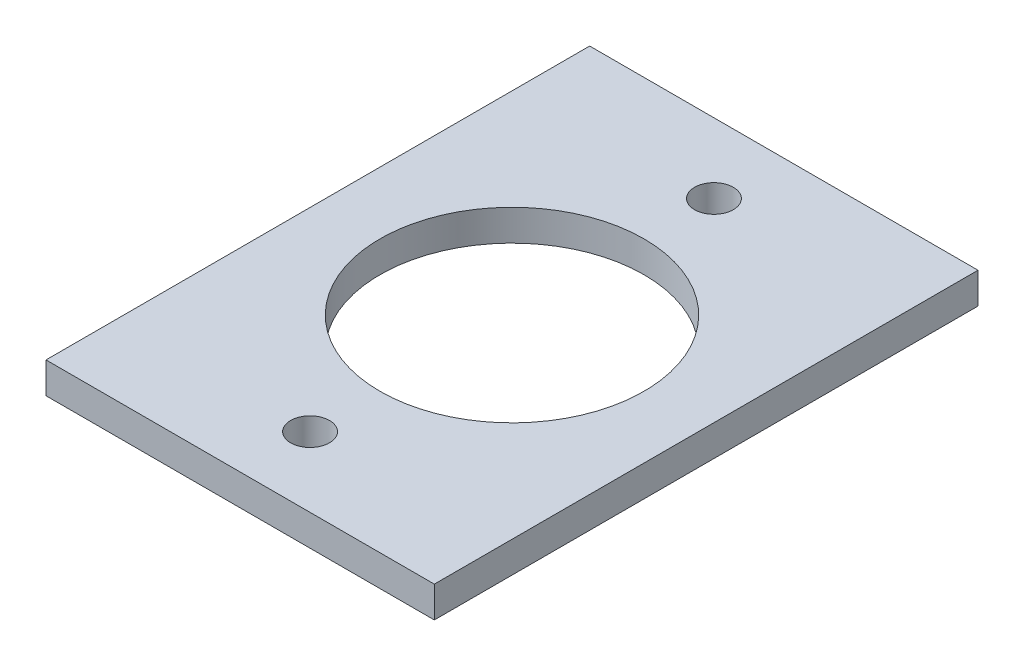
ISO-10303-21;
HEADER;
FILE_DESCRIPTION(('STEP AP214'),'2;1');
FILE_NAME('part.step','',(''),(''),'','','');
FILE_SCHEMA(('AUTOMOTIVE_DESIGN { 1 0 10303 214 1 1 1 1 }'));
ENDSEC;
DATA;
#1=APPLICATION_CONTEXT('core data for automotive mechanical design processes');
#2=APPLICATION_PROTOCOL_DEFINITION('international standard','automotive_design',2000,#1);
#3=PRODUCT_CONTEXT('',#1,'mechanical');
#4=PRODUCT('Part','Part','',(#3));
#5=PRODUCT_RELATED_PRODUCT_CATEGORY('part','',(#4));
#6=PRODUCT_DEFINITION_FORMATION('','',#4);
#7=PRODUCT_DEFINITION_CONTEXT('part definition',#1,'design');
#8=PRODUCT_DEFINITION('design','',#6,#7);
#9=PRODUCT_DEFINITION_SHAPE('','',#8);
#10=(LENGTH_UNIT() NAMED_UNIT(*) SI_UNIT(.MILLI.,.METRE.));
#11=(NAMED_UNIT(*) PLANE_ANGLE_UNIT() SI_UNIT($,.RADIAN.));
#12=(NAMED_UNIT(*) SI_UNIT($,.STERADIAN.) SOLID_ANGLE_UNIT());
#13=UNCERTAINTY_MEASURE_WITH_UNIT(LENGTH_MEASURE(1.E-05),#10,'distance_accuracy_value','');
#14=(GEOMETRIC_REPRESENTATION_CONTEXT(3) GLOBAL_UNCERTAINTY_ASSIGNED_CONTEXT((#13)) GLOBAL_UNIT_ASSIGNED_CONTEXT((#10,
#11,#12)) REPRESENTATION_CONTEXT('',''));
#15=CARTESIAN_POINT('',(0.,0.,0.));
#16=DIRECTION('',(0.,0.,1.));
#17=DIRECTION('',(1.,0.,0.));
#18=AXIS2_PLACEMENT_3D('',#15,#16,#17);
#19=CARTESIAN_POINT('',(0.,2.,0.));
#20=DIRECTION('',(0.,1.,0.));
#21=DIRECTION('',(0.,0.,1.));
#22=AXIS2_PLACEMENT_3D('',#19,#20,#21);
#23=PLANE('',#22);
#24=CARTESIAN_POINT('',(0.,2.,13.));
#25=DIRECTION('',(0.,1.,0.));
#26=DIRECTION('',(0.,0.,1.));
#27=AXIS2_PLACEMENT_3D('',#24,#25,#26);
#28=CIRCLE('',#27,1.25);
#29=CARTESIAN_POINT('',(0.,2.,14.25));
#30=VERTEX_POINT('',#29);
#31=EDGE_CURVE('E126',#30,#30,#28,.T.);
#32=ORIENTED_EDGE('',*,*,#31,.F.);
#33=EDGE_LOOP('',(#32));
#34=FACE_BOUND('',#33,.T.);
#35=CARTESIAN_POINT('',(0.,2.,-13.));
#36=DIRECTION('',(0.,1.,0.));
#37=DIRECTION('',(0.,0.,1.));
#38=AXIS2_PLACEMENT_3D('',#35,#36,#37);
#39=CIRCLE('',#38,1.25);
#40=CARTESIAN_POINT('',(0.,2.,-11.75));
#41=VERTEX_POINT('',#40);
#42=EDGE_CURVE('E120',#41,#41,#39,.T.);
#43=ORIENTED_EDGE('',*,*,#42,.F.);
#44=EDGE_LOOP('',(#43));
#45=FACE_BOUND('',#44,.T.);
#46=DIRECTION('',(0.,0.,1.));
#47=VECTOR('',#46,1.);
#48=CARTESIAN_POINT('',(-12.5,2.,17.5));
#49=LINE('',#48,#47);
#50=CARTESIAN_POINT('',(-12.5,2.,-17.5));
#51=VERTEX_POINT('',#50);
#52=CARTESIAN_POINT('',(-12.5,2.,17.5));
#53=VERTEX_POINT('',#52);
#54=EDGE_CURVE('E85',#51,#53,#49,.T.);
#55=ORIENTED_EDGE('',*,*,#54,.T.);
#56=DIRECTION('',(1.,0.,0.));
#57=VECTOR('',#56,1.);
#58=CARTESIAN_POINT('',(12.5,2.,17.5));
#59=LINE('',#58,#57);
#60=CARTESIAN_POINT('',(12.5,2.,17.5));
#61=VERTEX_POINT('',#60);
#62=EDGE_CURVE('E80',#53,#61,#59,.T.);
#63=ORIENTED_EDGE('',*,*,#62,.T.);
#64=DIRECTION('',(0.,0.,-1.));
#65=VECTOR('',#64,1.);
#66=CARTESIAN_POINT('',(12.5,2.,17.5));
#67=LINE('',#66,#65);
#68=CARTESIAN_POINT('',(12.5,2.,-17.5));
#69=VERTEX_POINT('',#68);
#70=EDGE_CURVE('E83',#61,#69,#67,.T.);
#71=ORIENTED_EDGE('',*,*,#70,.T.);
#72=DIRECTION('',(-1.,0.,0.));
#73=VECTOR('',#72,1.);
#74=CARTESIAN_POINT('',(12.5,2.,-17.5));
#75=LINE('',#74,#73);
#76=EDGE_CURVE('E50',#69,#51,#75,.T.);
#77=ORIENTED_EDGE('',*,*,#76,.T.);
#78=EDGE_LOOP('',(#55,#63,#71,#77));
#79=FACE_BOUND('',#78,.T.);
#80=CARTESIAN_POINT('',(0.,2.,0.));
#81=DIRECTION('',(0.,1.,0.));
#82=DIRECTION('',(0.,0.,1.));
#83=AXIS2_PLACEMENT_3D('',#80,#81,#82);
#84=CIRCLE('',#83,8.5);
#85=CARTESIAN_POINT('',(0.,2.,8.5));
#86=VERTEX_POINT('',#85);
#87=EDGE_CURVE('E100',#86,#86,#84,.T.);
#88=ORIENTED_EDGE('',*,*,#87,.F.);
#89=EDGE_LOOP('',(#88));
#90=FACE_BOUND('',#89,.T.);
#91=ADVANCED_FACE('F33',(#34,#45,#79,#90),#23,.T.);
#92=CARTESIAN_POINT('',(0.,0.,0.));
#93=DIRECTION('',(0.,1.,0.));
#94=DIRECTION('',(0.,0.,1.));
#95=AXIS2_PLACEMENT_3D('',#92,#93,#94);
#96=PLANE('',#95);
#97=CARTESIAN_POINT('',(0.,0.,13.));
#98=DIRECTION('',(0.,1.,0.));
#99=DIRECTION('',(0.,0.,1.));
#100=AXIS2_PLACEMENT_3D('',#97,#98,#99);
#101=CIRCLE('',#100,1.25);
#102=CARTESIAN_POINT('',(0.,0.,14.25));
#103=VERTEX_POINT('',#102);
#104=EDGE_CURVE('E123',#103,#103,#101,.T.);
#105=ORIENTED_EDGE('',*,*,#104,.T.);
#106=EDGE_LOOP('',(#105));
#107=FACE_BOUND('',#106,.T.);
#108=CARTESIAN_POINT('',(0.,0.,-13.));
#109=DIRECTION('',(0.,1.,0.));
#110=DIRECTION('',(0.,0.,1.));
#111=AXIS2_PLACEMENT_3D('',#108,#109,#110);
#112=CIRCLE('',#111,1.25);
#113=CARTESIAN_POINT('',(0.,0.,-11.75));
#114=VERTEX_POINT('',#113);
#115=EDGE_CURVE('E115',#114,#114,#112,.T.);
#116=ORIENTED_EDGE('',*,*,#115,.T.);
#117=EDGE_LOOP('',(#116));
#118=FACE_BOUND('',#117,.T.);
#119=DIRECTION('',(0.,0.,1.));
#120=VECTOR('',#119,1.);
#121=CARTESIAN_POINT('',(-12.5,0.,17.5));
#122=LINE('',#121,#120);
#123=CARTESIAN_POINT('',(-12.5,0.,-17.5));
#124=VERTEX_POINT('',#123);
#125=CARTESIAN_POINT('',(-12.5,0.,17.5));
#126=VERTEX_POINT('',#125);
#127=EDGE_CURVE('E97',#124,#126,#122,.T.);
#128=ORIENTED_EDGE('',*,*,#127,.F.);
#129=DIRECTION('',(-1.,0.,0.));
#130=VECTOR('',#129,1.);
#131=CARTESIAN_POINT('',(12.5,0.,-17.5));
#132=LINE('',#131,#130);
#133=CARTESIAN_POINT('',(12.5,0.,-17.5));
#134=VERTEX_POINT('',#133);
#135=EDGE_CURVE('E73',#134,#124,#132,.T.);
#136=ORIENTED_EDGE('',*,*,#135,.F.);
#137=DIRECTION('',(0.,0.,-1.));
#138=VECTOR('',#137,1.);
#139=CARTESIAN_POINT('',(12.5,0.,17.5));
#140=LINE('',#139,#138);
#141=CARTESIAN_POINT('',(12.5,0.,17.5));
#142=VERTEX_POINT('',#141);
#143=EDGE_CURVE('E67',#142,#134,#140,.T.);
#144=ORIENTED_EDGE('',*,*,#143,.F.);
#145=DIRECTION('',(1.,0.,0.));
#146=VECTOR('',#145,1.);
#147=CARTESIAN_POINT('',(12.5,0.,17.5));
#148=LINE('',#147,#146);
#149=EDGE_CURVE('E89',#126,#142,#148,.T.);
#150=ORIENTED_EDGE('',*,*,#149,.F.);
#151=EDGE_LOOP('',(#128,#136,#144,#150));
#152=FACE_BOUND('',#151,.T.);
#153=CARTESIAN_POINT('',(0.,0.,0.));
#154=DIRECTION('',(0.,1.,0.));
#155=DIRECTION('',(0.,0.,1.));
#156=AXIS2_PLACEMENT_3D('',#153,#154,#155);
#157=CIRCLE('',#156,8.5);
#158=CARTESIAN_POINT('',(0.,0.,8.5));
#159=VERTEX_POINT('',#158);
#160=EDGE_CURVE('E112',#159,#159,#157,.T.);
#161=ORIENTED_EDGE('',*,*,#160,.T.);
#162=EDGE_LOOP('',(#161));
#163=FACE_BOUND('',#162,.T.);
#164=ADVANCED_FACE('F108',(#107,#118,#152,#163),#96,.F.);
#165=CARTESIAN_POINT('',(-12.5,2.,17.5));
#166=DIRECTION('',(1.,0.,0.));
#167=DIRECTION('',(0.,0.,-1.));
#168=AXIS2_PLACEMENT_3D('',#165,#166,#167);
#169=PLANE('',#168);
#170=ORIENTED_EDGE('',*,*,#127,.T.);
#171=DIRECTION('',(0.,-1.,0.));
#172=VECTOR('',#171,1.);
#173=CARTESIAN_POINT('',(-12.5,2.,17.5));
#174=LINE('',#173,#172);
#175=EDGE_CURVE('E11',#53,#126,#174,.T.);
#176=ORIENTED_EDGE('',*,*,#175,.F.);
#177=ORIENTED_EDGE('',*,*,#54,.F.);
#178=DIRECTION('',(0.,-1.,0.));
#179=VECTOR('',#178,1.);
#180=CARTESIAN_POINT('',(-12.5,2.,-17.5));
#181=LINE('',#180,#179);
#182=EDGE_CURVE('E93',#51,#124,#181,.T.);
#183=ORIENTED_EDGE('',*,*,#182,.T.);
#184=EDGE_LOOP('',(#170,#176,#177,#183));
#185=FACE_BOUND('',#184,.T.);
#186=ADVANCED_FACE('F35',(#185),#169,.F.);
#187=CARTESIAN_POINT('',(12.5,2.,17.5));
#188=DIRECTION('',(0.,0.,-1.));
#189=DIRECTION('',(-1.,0.,0.));
#190=AXIS2_PLACEMENT_3D('',#187,#188,#189);
#191=PLANE('',#190);
#192=ORIENTED_EDGE('',*,*,#149,.T.);
#193=DIRECTION('',(0.,-1.,0.));
#194=VECTOR('',#193,1.);
#195=CARTESIAN_POINT('',(12.5,2.,17.5));
#196=LINE('',#195,#194);
#197=EDGE_CURVE('E42',#61,#142,#196,.T.);
#198=ORIENTED_EDGE('',*,*,#197,.F.);
#199=ORIENTED_EDGE('',*,*,#62,.F.);
#200=ORIENTED_EDGE('',*,*,#175,.T.);
#201=EDGE_LOOP('',(#192,#198,#199,#200));
#202=FACE_BOUND('',#201,.T.);
#203=ADVANCED_FACE('F88',(#202),#191,.F.);
#204=CARTESIAN_POINT('',(12.5,2.,17.5));
#205=DIRECTION('',(-1.,0.,0.));
#206=DIRECTION('',(0.,0.,1.));
#207=AXIS2_PLACEMENT_3D('',#204,#205,#206);
#208=PLANE('',#207);
#209=ORIENTED_EDGE('',*,*,#143,.T.);
#210=DIRECTION('',(0.,-1.,0.));
#211=VECTOR('',#210,1.);
#212=CARTESIAN_POINT('',(12.5,2.,-17.5));
#213=LINE('',#212,#211);
#214=EDGE_CURVE('E90',#69,#134,#213,.T.);
#215=ORIENTED_EDGE('',*,*,#214,.F.);
#216=ORIENTED_EDGE('',*,*,#70,.F.);
#217=ORIENTED_EDGE('',*,*,#197,.T.);
#218=EDGE_LOOP('',(#209,#215,#216,#217));
#219=FACE_BOUND('',#218,.T.);
#220=ADVANCED_FACE('F91',(#219),#208,.F.);
#221=CARTESIAN_POINT('',(12.5,2.,-17.5));
#222=DIRECTION('',(0.,0.,1.));
#223=DIRECTION('',(1.,0.,0.));
#224=AXIS2_PLACEMENT_3D('',#221,#222,#223);
#225=PLANE('',#224);
#226=ORIENTED_EDGE('',*,*,#135,.T.);
#227=ORIENTED_EDGE('',*,*,#182,.F.);
#228=ORIENTED_EDGE('',*,*,#76,.F.);
#229=ORIENTED_EDGE('',*,*,#214,.T.);
#230=EDGE_LOOP('',(#226,#227,#228,#229));
#231=FACE_BOUND('',#230,.T.);
#232=ADVANCED_FACE('F105',(#231),#225,.F.);
#233=CARTESIAN_POINT('',(0.,2.,0.));
#234=DIRECTION('',(0.,-1.,0.));
#235=DIRECTION('',(0.,0.,-1.));
#236=AXIS2_PLACEMENT_3D('',#233,#234,#235);
#237=CYLINDRICAL_SURFACE('',#236,8.5);
#238=ORIENTED_EDGE('',*,*,#87,.T.);
#239=EDGE_LOOP('',(#238));
#240=FACE_BOUND('',#239,.T.);
#241=ORIENTED_EDGE('',*,*,#160,.F.);
#242=EDGE_LOOP('',(#241));
#243=FACE_BOUND('',#242,.T.);
#244=ADVANCED_FACE('F139',(#240,#243),#237,.F.);
#245=CARTESIAN_POINT('',(0.,2.,-13.));
#246=DIRECTION('',(0.,1.,0.));
#247=DIRECTION('',(0.,0.,1.));
#248=AXIS2_PLACEMENT_3D('',#245,#246,#247);
#249=CYLINDRICAL_SURFACE('',#248,1.25);
#250=ORIENTED_EDGE('',*,*,#115,.F.);
#251=EDGE_LOOP('',(#250));
#252=FACE_BOUND('',#251,.T.);
#253=ORIENTED_EDGE('',*,*,#42,.T.);
#254=EDGE_LOOP('',(#253));
#255=FACE_BOUND('',#254,.T.);
#256=ADVANCED_FACE('F137',(#252,#255),#249,.F.);
#257=CARTESIAN_POINT('',(0.,2.,13.));
#258=DIRECTION('',(0.,1.,0.));
#259=DIRECTION('',(0.,0.,1.));
#260=AXIS2_PLACEMENT_3D('',#257,#258,#259);
#261=CYLINDRICAL_SURFACE('',#260,1.25);
#262=ORIENTED_EDGE('',*,*,#104,.F.);
#263=EDGE_LOOP('',(#262));
#264=FACE_BOUND('',#263,.T.);
#265=ORIENTED_EDGE('',*,*,#31,.T.);
#266=EDGE_LOOP('',(#265));
#267=FACE_BOUND('',#266,.T.);
#268=ADVANCED_FACE('F130',(#264,#267),#261,.F.);
#269=CLOSED_SHELL('',(#91,#164,#186,#203,#220,#232,#244,#256,#268));
#270=MANIFOLD_SOLID_BREP('B2',#269);
#271=ADVANCED_BREP_SHAPE_REPRESENTATION('',(#18,#270),#14);
#272=SHAPE_DEFINITION_REPRESENTATION(#9,#271);
ENDSEC;
END-ISO-10303-21;
